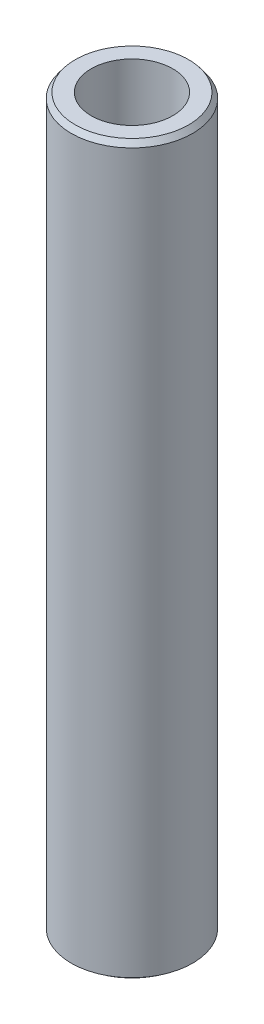
ISO-10303-21;
HEADER;
FILE_DESCRIPTION(('STEP AP214'),'2;1');
FILE_NAME('part.step','',(''),(''),'','','');
FILE_SCHEMA(('AUTOMOTIVE_DESIGN { 1 0 10303 214 1 1 1 1 }'));
ENDSEC;
DATA;
#1=APPLICATION_CONTEXT('core data for automotive mechanical design processes');
#2=APPLICATION_PROTOCOL_DEFINITION('international standard','automotive_design',2000,#1);
#3=PRODUCT_CONTEXT('',#1,'mechanical');
#4=PRODUCT('Part','Part','',(#3));
#5=PRODUCT_RELATED_PRODUCT_CATEGORY('part','',(#4));
#6=PRODUCT_DEFINITION_FORMATION('','',#4);
#7=PRODUCT_DEFINITION_CONTEXT('part definition',#1,'design');
#8=PRODUCT_DEFINITION('design','',#6,#7);
#9=PRODUCT_DEFINITION_SHAPE('','',#8);
#10=(LENGTH_UNIT() NAMED_UNIT(*) SI_UNIT(.MILLI.,.METRE.));
#11=(NAMED_UNIT(*) PLANE_ANGLE_UNIT() SI_UNIT($,.RADIAN.));
#12=(NAMED_UNIT(*) SI_UNIT($,.STERADIAN.) SOLID_ANGLE_UNIT());
#13=UNCERTAINTY_MEASURE_WITH_UNIT(LENGTH_MEASURE(1.E-05),#10,'distance_accuracy_value','');
#14=(GEOMETRIC_REPRESENTATION_CONTEXT(3) GLOBAL_UNCERTAINTY_ASSIGNED_CONTEXT((#13)) GLOBAL_UNIT_ASSIGNED_CONTEXT((#10,
#11,#12)) REPRESENTATION_CONTEXT('',''));
#15=CARTESIAN_POINT('',(0.,0.,0.));
#16=DIRECTION('',(0.,0.,1.));
#17=DIRECTION('',(1.,0.,0.));
#18=AXIS2_PLACEMENT_3D('',#15,#16,#17);
#19=CARTESIAN_POINT('',(0.,600.,0.));
#20=DIRECTION('',(0.,-1.,0.));
#21=DIRECTION('',(0.,0.,-1.));
#22=AXIS2_PLACEMENT_3D('',#19,#20,#21);
#23=CYLINDRICAL_SURFACE('',#22,50.);
#24=CARTESIAN_POINT('',(0.,595.574446032495,0.));
#25=DIRECTION('',(0.,1.,0.));
#26=DIRECTION('',(0.,0.,1.));
#27=AXIS2_PLACEMENT_3D('',#24,#25,#26);
#28=CIRCLE('',#27,50.);
#29=CARTESIAN_POINT('',(0.,595.574446032495,50.));
#30=VERTEX_POINT('',#29);
#31=EDGE_CURVE('E50',#30,#30,#28,.F.);
#32=ORIENTED_EDGE('',*,*,#31,.T.);
#33=EDGE_LOOP('',(#32));
#34=FACE_BOUND('',#33,.T.);
#35=CARTESIAN_POINT('',(0.,3.32693515448323,0.));
#36=DIRECTION('',(0.,1.,0.));
#37=DIRECTION('',(0.,0.,1.));
#38=AXIS2_PLACEMENT_3D('',#35,#36,#37);
#39=CIRCLE('',#38,50.);
#40=CARTESIAN_POINT('',(0.,3.32693515448323,50.));
#41=VERTEX_POINT('',#40);
#42=EDGE_CURVE('E51',#41,#41,#39,.T.);
#43=ORIENTED_EDGE('',*,*,#42,.T.);
#44=EDGE_LOOP('',(#43));
#45=FACE_BOUND('',#44,.T.);
#46=ADVANCED_FACE('F39',(#34,#45),#23,.T.);
#47=CARTESIAN_POINT('',(0.,600.,0.));
#48=DIRECTION('',(0.,1.,0.));
#49=DIRECTION('',(0.,0.,1.));
#50=AXIS2_PLACEMENT_3D('',#47,#48,#49);
#51=PLANE('',#50);
#52=CARTESIAN_POINT('',(0.,600.,0.));
#53=DIRECTION('',(0.,1.,0.));
#54=DIRECTION('',(0.,0.,1.));
#55=AXIS2_PLACEMENT_3D('',#52,#53,#54);
#56=CIRCLE('',#55,46.6730648455166);
#57=CARTESIAN_POINT('',(0.,600.,46.6730648455166));
#58=VERTEX_POINT('',#57);
#59=EDGE_CURVE('E54',#58,#58,#56,.T.);
#60=ORIENTED_EDGE('',*,*,#59,.T.);
#61=EDGE_LOOP('',(#60));
#62=FACE_BOUND('',#61,.T.);
#63=CARTESIAN_POINT('',(0.,600.,0.));
#64=DIRECTION('',(0.,1.,0.));
#65=DIRECTION('',(0.,0.,1.));
#66=AXIS2_PLACEMENT_3D('',#63,#64,#65);
#67=CIRCLE('',#66,33.6063666659296);
#68=CARTESIAN_POINT('',(0.,600.,33.6063666659296));
#69=VERTEX_POINT('',#68);
#70=EDGE_CURVE('E58',#69,#69,#67,.T.);
#71=ORIENTED_EDGE('',*,*,#70,.F.);
#72=EDGE_LOOP('',(#71));
#73=FACE_BOUND('',#72,.T.);
#74=ADVANCED_FACE('F69',(#62,#73),#51,.T.);
#75=CARTESIAN_POINT('',(0.,0.,0.));
#76=DIRECTION('',(0.,1.,0.));
#77=DIRECTION('',(0.,0.,1.));
#78=AXIS2_PLACEMENT_3D('',#75,#76,#77);
#79=PLANE('',#78);
#80=CARTESIAN_POINT('',(0.,0.,0.));
#81=DIRECTION('',(0.,1.,0.));
#82=DIRECTION('',(0.,0.,1.));
#83=AXIS2_PLACEMENT_3D('',#80,#81,#82);
#84=CIRCLE('',#83,45.5744460324949);
#85=CARTESIAN_POINT('',(0.,0.,45.5744460324949));
#86=VERTEX_POINT('',#85);
#87=EDGE_CURVE('E10',#86,#86,#84,.F.);
#88=ORIENTED_EDGE('',*,*,#87,.T.);
#89=EDGE_LOOP('',(#88));
#90=FACE_BOUND('',#89,.T.);
#91=CARTESIAN_POINT('',(0.,0.,0.));
#92=DIRECTION('',(0.,1.,0.));
#93=DIRECTION('',(0.,0.,1.));
#94=AXIS2_PLACEMENT_3D('',#91,#92,#93);
#95=CIRCLE('',#94,33.6063666659296);
#96=CARTESIAN_POINT('',(0.,0.,33.6063666659296));
#97=VERTEX_POINT('',#96);
#98=EDGE_CURVE('E63',#97,#97,#95,.T.);
#99=ORIENTED_EDGE('',*,*,#98,.T.);
#100=EDGE_LOOP('',(#99));
#101=FACE_BOUND('',#100,.T.);
#102=ADVANCED_FACE('F75',(#90,#101),#79,.F.);
#103=CARTESIAN_POINT('',(0.,600.,0.));
#104=DIRECTION('',(0.,-1.,0.));
#105=DIRECTION('',(0.,0.,-1.));
#106=AXIS2_PLACEMENT_3D('',#103,#104,#105);
#107=CYLINDRICAL_SURFACE('',#106,33.6063666659296);
#108=ORIENTED_EDGE('',*,*,#70,.T.);
#109=EDGE_LOOP('',(#108));
#110=FACE_BOUND('',#109,.T.);
#111=ORIENTED_EDGE('',*,*,#98,.F.);
#112=EDGE_LOOP('',(#111));
#113=FACE_BOUND('',#112,.T.);
#114=ADVANCED_FACE('F70',(#110,#113),#107,.F.);
#115=CARTESIAN_POINT('',(0.,600.,0.));
#116=DIRECTION('',(0.,-1.,0.));
#117=DIRECTION('',(0.,0.,-1.));
#118=AXIS2_PLACEMENT_3D('',#115,#116,#117);
#119=CONICAL_SURFACE('',#118,46.6730648455166,0.644623771742072);
#120=ORIENTED_EDGE('',*,*,#31,.F.);
#121=EDGE_LOOP('',(#120));
#122=FACE_BOUND('',#121,.T.);
#123=ORIENTED_EDGE('',*,*,#59,.F.);
#124=EDGE_LOOP('',(#123));
#125=FACE_BOUND('',#124,.T.);
#126=ADVANCED_FACE('F81',(#122,#125),#119,.T.);
#127=CARTESIAN_POINT('',(0.,3.32693515448323,0.));
#128=DIRECTION('',(0.,1.,0.));
#129=DIRECTION('',(0.,0.,1.));
#130=AXIS2_PLACEMENT_3D('',#127,#128,#129);
#131=CONICAL_SURFACE('',#130,50.,0.926172555052851);
#132=ORIENTED_EDGE('',*,*,#87,.F.);
#133=EDGE_LOOP('',(#132));
#134=FACE_BOUND('',#133,.T.);
#135=ORIENTED_EDGE('',*,*,#42,.F.);
#136=EDGE_LOOP('',(#135));
#137=FACE_BOUND('',#136,.T.);
#138=ADVANCED_FACE('F45',(#134,#137),#131,.T.);
#139=CLOSED_SHELL('',(#46,#74,#102,#114,#126,#138));
#140=MANIFOLD_SOLID_BREP('B2',#139);
#141=ADVANCED_BREP_SHAPE_REPRESENTATION('',(#18,#140),#14);
#142=SHAPE_DEFINITION_REPRESENTATION(#9,#141);
ENDSEC;
END-ISO-10303-21;
